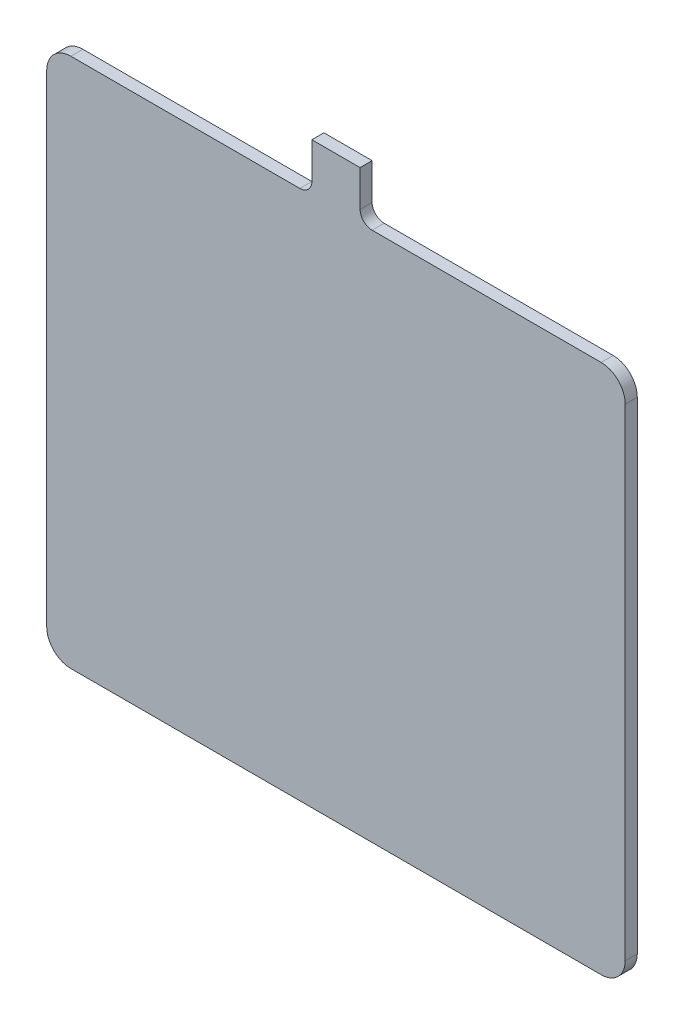
ISO-10303-21;
HEADER;
FILE_DESCRIPTION(('STEP AP214'),'2;1');
FILE_NAME('part.step','',(''),(''),'','','');
FILE_SCHEMA(('AUTOMOTIVE_DESIGN { 1 0 10303 214 1 1 1 1 }'));
ENDSEC;
DATA;
#1=APPLICATION_CONTEXT('core data for automotive mechanical design processes');
#2=APPLICATION_PROTOCOL_DEFINITION('international standard','automotive_design',2000,#1);
#3=PRODUCT_CONTEXT('',#1,'mechanical');
#4=PRODUCT('Part','Part','',(#3));
#5=PRODUCT_RELATED_PRODUCT_CATEGORY('part','',(#4));
#6=PRODUCT_DEFINITION_FORMATION('','',#4);
#7=PRODUCT_DEFINITION_CONTEXT('part definition',#1,'design');
#8=PRODUCT_DEFINITION('design','',#6,#7);
#9=PRODUCT_DEFINITION_SHAPE('','',#8);
#10=(LENGTH_UNIT() NAMED_UNIT(*) SI_UNIT(.MILLI.,.METRE.));
#11=(NAMED_UNIT(*) PLANE_ANGLE_UNIT() SI_UNIT($,.RADIAN.));
#12=(NAMED_UNIT(*) SI_UNIT($,.STERADIAN.) SOLID_ANGLE_UNIT());
#13=UNCERTAINTY_MEASURE_WITH_UNIT(LENGTH_MEASURE(1.E-05),#10,'distance_accuracy_value','');
#14=(GEOMETRIC_REPRESENTATION_CONTEXT(3) GLOBAL_UNCERTAINTY_ASSIGNED_CONTEXT((#13)) GLOBAL_UNIT_ASSIGNED_CONTEXT((#10,
#11,#12)) REPRESENTATION_CONTEXT('',''));
#15=CARTESIAN_POINT('',(0.,0.,0.));
#16=DIRECTION('',(0.,0.,1.));
#17=DIRECTION('',(1.,0.,0.));
#18=AXIS2_PLACEMENT_3D('',#15,#16,#17);
#19=CARTESIAN_POINT('',(-30.,305.,10.));
#20=DIRECTION('',(0.,0.,-1.));
#21=DIRECTION('',(-1.,0.,0.));
#22=AXIS2_PLACEMENT_3D('',#19,#20,#21);
#23=CYLINDRICAL_SURFACE('',#22,10.);
#24=CARTESIAN_POINT('',(-30.,305.,0.));
#25=DIRECTION('',(0.,0.,-1.));
#26=DIRECTION('',(1.,0.,0.));
#27=AXIS2_PLACEMENT_3D('',#24,#25,#26);
#28=CIRCLE('',#27,10.);
#29=CARTESIAN_POINT('',(-20.,305.,0.));
#30=VERTEX_POINT('',#29);
#31=CARTESIAN_POINT('',(-30.,295.,0.));
#32=VERTEX_POINT('',#31);
#33=EDGE_CURVE('E165',#30,#32,#28,.T.);
#34=ORIENTED_EDGE('',*,*,#33,.T.);
#35=DIRECTION('',(0.,0.,-1.));
#36=VECTOR('',#35,1.);
#37=CARTESIAN_POINT('',(-30.,295.,10.));
#38=LINE('',#37,#36);
#39=CARTESIAN_POINT('',(-30.,295.,10.));
#40=VERTEX_POINT('',#39);
#41=EDGE_CURVE('E11',#40,#32,#38,.T.);
#42=ORIENTED_EDGE('',*,*,#41,.F.);
#43=CARTESIAN_POINT('',(-30.,305.,10.));
#44=DIRECTION('',(0.,0.,-1.));
#45=DIRECTION('',(1.,0.,0.));
#46=AXIS2_PLACEMENT_3D('',#43,#44,#45);
#47=CIRCLE('',#46,10.);
#48=CARTESIAN_POINT('',(-20.,305.,10.));
#49=VERTEX_POINT('',#48);
#50=EDGE_CURVE('E191',#49,#40,#47,.T.);
#51=ORIENTED_EDGE('',*,*,#50,.F.);
#52=DIRECTION('',(0.,0.,-1.));
#53=VECTOR('',#52,1.);
#54=CARTESIAN_POINT('',(-20.,305.,10.));
#55=LINE('',#54,#53);
#56=EDGE_CURVE('E161',#49,#30,#55,.T.);
#57=ORIENTED_EDGE('',*,*,#56,.T.);
#58=EDGE_LOOP('',(#34,#42,#51,#57));
#59=FACE_BOUND('',#58,.T.);
#60=ADVANCED_FACE('F33',(#59),#23,.F.);
#61=CARTESIAN_POINT('',(-220.,295.,10.));
#62=DIRECTION('',(0.,-1.,0.));
#63=DIRECTION('',(0.,0.,-1.));
#64=AXIS2_PLACEMENT_3D('',#61,#62,#63);
#65=PLANE('',#64);
#66=DIRECTION('',(-1.,0.,0.));
#67=VECTOR('',#66,1.);
#68=CARTESIAN_POINT('',(-220.,295.,0.));
#69=LINE('',#68,#67);
#70=CARTESIAN_POINT('',(-220.,295.,0.));
#71=VERTEX_POINT('',#70);
#72=EDGE_CURVE('E168',#32,#71,#69,.T.);
#73=ORIENTED_EDGE('',*,*,#72,.T.);
#74=DIRECTION('',(0.,0.,-1.));
#75=VECTOR('',#74,1.);
#76=CARTESIAN_POINT('',(-220.,295.,10.));
#77=LINE('',#76,#75);
#78=CARTESIAN_POINT('',(-220.,295.,10.));
#79=VERTEX_POINT('',#78);
#80=EDGE_CURVE('E41',#79,#71,#77,.T.);
#81=ORIENTED_EDGE('',*,*,#80,.F.);
#82=DIRECTION('',(-1.,0.,0.));
#83=VECTOR('',#82,1.);
#84=CARTESIAN_POINT('',(-220.,295.,10.));
#85=LINE('',#84,#83);
#86=EDGE_CURVE('E110',#40,#79,#85,.T.);
#87=ORIENTED_EDGE('',*,*,#86,.F.);
#88=ORIENTED_EDGE('',*,*,#41,.T.);
#89=EDGE_LOOP('',(#73,#81,#87,#88));
#90=FACE_BOUND('',#89,.T.);
#91=ADVANCED_FACE('F279',(#90),#65,.F.);
#92=CARTESIAN_POINT('',(-220.,275.,10.));
#93=DIRECTION('',(0.,0.,-1.));
#94=DIRECTION('',(-1.,0.,0.));
#95=AXIS2_PLACEMENT_3D('',#92,#93,#94);
#96=CYLINDRICAL_SURFACE('',#95,20.);
#97=CARTESIAN_POINT('',(-220.,275.,0.));
#98=DIRECTION('',(0.,0.,1.));
#99=DIRECTION('',(1.,0.,0.));
#100=AXIS2_PLACEMENT_3D('',#97,#98,#99);
#101=CIRCLE('',#100,20.);
#102=CARTESIAN_POINT('',(-240.,275.,0.));
#103=VERTEX_POINT('',#102);
#104=EDGE_CURVE('E170',#71,#103,#101,.T.);
#105=ORIENTED_EDGE('',*,*,#104,.T.);
#106=DIRECTION('',(0.,0.,-1.));
#107=VECTOR('',#106,1.);
#108=CARTESIAN_POINT('',(-240.,275.,10.));
#109=LINE('',#108,#107);
#110=CARTESIAN_POINT('',(-240.,275.,10.));
#111=VERTEX_POINT('',#110);
#112=EDGE_CURVE('E216',#111,#103,#109,.T.);
#113=ORIENTED_EDGE('',*,*,#112,.F.);
#114=CARTESIAN_POINT('',(-220.,275.,10.));
#115=DIRECTION('',(0.,0.,1.));
#116=DIRECTION('',(1.,0.,0.));
#117=AXIS2_PLACEMENT_3D('',#114,#115,#116);
#118=CIRCLE('',#117,20.);
#119=EDGE_CURVE('E224',#79,#111,#118,.T.);
#120=ORIENTED_EDGE('',*,*,#119,.F.);
#121=ORIENTED_EDGE('',*,*,#80,.T.);
#122=EDGE_LOOP('',(#105,#113,#120,#121));
#123=FACE_BOUND('',#122,.T.);
#124=ADVANCED_FACE('F222',(#123),#96,.T.);
#125=CARTESIAN_POINT('',(-240.,275.,10.));
#126=DIRECTION('',(1.,0.,0.));
#127=DIRECTION('',(0.,1.,0.));
#128=AXIS2_PLACEMENT_3D('',#125,#126,#127);
#129=PLANE('',#128);
#130=DIRECTION('',(0.,-1.,0.));
#131=VECTOR('',#130,1.);
#132=CARTESIAN_POINT('',(-240.,275.,0.));
#133=LINE('',#132,#131);
#134=CARTESIAN_POINT('',(-240.,-125.,0.));
#135=VERTEX_POINT('',#134);
#136=EDGE_CURVE('E172',#103,#135,#133,.T.);
#137=ORIENTED_EDGE('',*,*,#136,.T.);
#138=DIRECTION('',(0.,0.,-1.));
#139=VECTOR('',#138,1.);
#140=CARTESIAN_POINT('',(-240.,-125.,10.));
#141=LINE('',#140,#139);
#142=CARTESIAN_POINT('',(-240.,-125.,10.));
#143=VERTEX_POINT('',#142);
#144=EDGE_CURVE('E213',#143,#135,#141,.T.);
#145=ORIENTED_EDGE('',*,*,#144,.F.);
#146=DIRECTION('',(0.,-1.,0.));
#147=VECTOR('',#146,1.);
#148=CARTESIAN_POINT('',(-240.,275.,10.));
#149=LINE('',#148,#147);
#150=EDGE_CURVE('E242',#111,#143,#149,.T.);
#151=ORIENTED_EDGE('',*,*,#150,.F.);
#152=ORIENTED_EDGE('',*,*,#112,.T.);
#153=EDGE_LOOP('',(#137,#145,#151,#152));
#154=FACE_BOUND('',#153,.T.);
#155=ADVANCED_FACE('F233',(#154),#129,.F.);
#156=CARTESIAN_POINT('',(-220.,-125.,10.));
#157=DIRECTION('',(0.,0.,-1.));
#158=DIRECTION('',(-1.,0.,0.));
#159=AXIS2_PLACEMENT_3D('',#156,#157,#158);
#160=CYLINDRICAL_SURFACE('',#159,20.);
#161=CARTESIAN_POINT('',(-220.,-125.,0.));
#162=DIRECTION('',(0.,0.,1.));
#163=DIRECTION('',(1.,0.,0.));
#164=AXIS2_PLACEMENT_3D('',#161,#162,#163);
#165=CIRCLE('',#164,20.);
#166=CARTESIAN_POINT('',(-220.,-145.,0.));
#167=VERTEX_POINT('',#166);
#168=EDGE_CURVE('E174',#135,#167,#165,.T.);
#169=ORIENTED_EDGE('',*,*,#168,.T.);
#170=DIRECTION('',(0.,0.,-1.));
#171=VECTOR('',#170,1.);
#172=CARTESIAN_POINT('',(-220.,-145.,10.));
#173=LINE('',#172,#171);
#174=CARTESIAN_POINT('',(-220.,-145.,10.));
#175=VERTEX_POINT('',#174);
#176=EDGE_CURVE('E210',#175,#167,#173,.T.);
#177=ORIENTED_EDGE('',*,*,#176,.F.);
#178=CARTESIAN_POINT('',(-220.,-125.,10.));
#179=DIRECTION('',(0.,0.,1.));
#180=DIRECTION('',(1.,0.,0.));
#181=AXIS2_PLACEMENT_3D('',#178,#179,#180);
#182=CIRCLE('',#181,20.);
#183=EDGE_CURVE('E239',#143,#175,#182,.T.);
#184=ORIENTED_EDGE('',*,*,#183,.F.);
#185=ORIENTED_EDGE('',*,*,#144,.T.);
#186=EDGE_LOOP('',(#169,#177,#184,#185));
#187=FACE_BOUND('',#186,.T.);
#188=ADVANCED_FACE('F237',(#187),#160,.T.);
#189=CARTESIAN_POINT('',(-220.,-145.,10.));
#190=DIRECTION('',(0.,1.,0.));
#191=DIRECTION('',(0.,0.,1.));
#192=AXIS2_PLACEMENT_3D('',#189,#190,#191);
#193=PLANE('',#192);
#194=DIRECTION('',(1.,0.,0.));
#195=VECTOR('',#194,1.);
#196=CARTESIAN_POINT('',(-220.,-145.,0.));
#197=LINE('',#196,#195);
#198=CARTESIAN_POINT('',(220.,-145.,0.));
#199=VERTEX_POINT('',#198);
#200=EDGE_CURVE('E176',#167,#199,#197,.T.);
#201=ORIENTED_EDGE('',*,*,#200,.T.);
#202=DIRECTION('',(0.,0.,-1.));
#203=VECTOR('',#202,1.);
#204=CARTESIAN_POINT('',(220.,-145.,10.));
#205=LINE('',#204,#203);
#206=CARTESIAN_POINT('',(220.,-145.,10.));
#207=VERTEX_POINT('',#206);
#208=EDGE_CURVE('E207',#207,#199,#205,.T.);
#209=ORIENTED_EDGE('',*,*,#208,.F.);
#210=DIRECTION('',(1.,0.,0.));
#211=VECTOR('',#210,1.);
#212=CARTESIAN_POINT('',(-220.,-145.,10.));
#213=LINE('',#212,#211);
#214=EDGE_CURVE('E241',#175,#207,#213,.T.);
#215=ORIENTED_EDGE('',*,*,#214,.F.);
#216=ORIENTED_EDGE('',*,*,#176,.T.);
#217=EDGE_LOOP('',(#201,#209,#215,#216));
#218=FACE_BOUND('',#217,.T.);
#219=ADVANCED_FACE('F292',(#218),#193,.F.);
#220=CARTESIAN_POINT('',(220.,-125.,10.));
#221=DIRECTION('',(0.,0.,-1.));
#222=DIRECTION('',(-1.,0.,0.));
#223=AXIS2_PLACEMENT_3D('',#220,#221,#222);
#224=CYLINDRICAL_SURFACE('',#223,20.);
#225=CARTESIAN_POINT('',(220.,-125.,0.));
#226=DIRECTION('',(0.,0.,1.));
#227=DIRECTION('',(1.,0.,0.));
#228=AXIS2_PLACEMENT_3D('',#225,#226,#227);
#229=CIRCLE('',#228,20.);
#230=CARTESIAN_POINT('',(240.,-125.,0.));
#231=VERTEX_POINT('',#230);
#232=EDGE_CURVE('E178',#199,#231,#229,.T.);
#233=ORIENTED_EDGE('',*,*,#232,.T.);
#234=DIRECTION('',(0.,0.,-1.));
#235=VECTOR('',#234,1.);
#236=CARTESIAN_POINT('',(240.,-125.,10.));
#237=LINE('',#236,#235);
#238=CARTESIAN_POINT('',(240.,-125.,10.));
#239=VERTEX_POINT('',#238);
#240=EDGE_CURVE('E204',#239,#231,#237,.T.);
#241=ORIENTED_EDGE('',*,*,#240,.F.);
#242=CARTESIAN_POINT('',(220.,-125.,10.));
#243=DIRECTION('',(0.,0.,1.));
#244=DIRECTION('',(1.,0.,0.));
#245=AXIS2_PLACEMENT_3D('',#242,#243,#244);
#246=CIRCLE('',#245,20.);
#247=EDGE_CURVE('E244',#207,#239,#246,.T.);
#248=ORIENTED_EDGE('',*,*,#247,.F.);
#249=ORIENTED_EDGE('',*,*,#208,.T.);
#250=EDGE_LOOP('',(#233,#241,#248,#249));
#251=FACE_BOUND('',#250,.T.);
#252=ADVANCED_FACE('F295',(#251),#224,.T.);
#253=CARTESIAN_POINT('',(240.,275.,10.));
#254=DIRECTION('',(-1.,0.,0.));
#255=DIRECTION('',(0.,-1.,0.));
#256=AXIS2_PLACEMENT_3D('',#253,#254,#255);
#257=PLANE('',#256);
#258=DIRECTION('',(0.,1.,0.));
#259=VECTOR('',#258,1.);
#260=CARTESIAN_POINT('',(240.,275.,0.));
#261=LINE('',#260,#259);
#262=CARTESIAN_POINT('',(240.,275.,0.));
#263=VERTEX_POINT('',#262);
#264=EDGE_CURVE('E180',#231,#263,#261,.T.);
#265=ORIENTED_EDGE('',*,*,#264,.T.);
#266=DIRECTION('',(0.,0.,-1.));
#267=VECTOR('',#266,1.);
#268=CARTESIAN_POINT('',(240.,275.,10.));
#269=LINE('',#268,#267);
#270=CARTESIAN_POINT('',(240.,275.,10.));
#271=VERTEX_POINT('',#270);
#272=EDGE_CURVE('E201',#271,#263,#269,.T.);
#273=ORIENTED_EDGE('',*,*,#272,.F.);
#274=DIRECTION('',(0.,1.,0.));
#275=VECTOR('',#274,1.);
#276=CARTESIAN_POINT('',(240.,275.,10.));
#277=LINE('',#276,#275);
#278=EDGE_CURVE('E250',#239,#271,#277,.T.);
#279=ORIENTED_EDGE('',*,*,#278,.F.);
#280=ORIENTED_EDGE('',*,*,#240,.T.);
#281=EDGE_LOOP('',(#265,#273,#279,#280));
#282=FACE_BOUND('',#281,.T.);
#283=ADVANCED_FACE('F299',(#282),#257,.F.);
#284=CARTESIAN_POINT('',(220.,275.,10.));
#285=DIRECTION('',(0.,0.,-1.));
#286=DIRECTION('',(-1.,0.,0.));
#287=AXIS2_PLACEMENT_3D('',#284,#285,#286);
#288=CYLINDRICAL_SURFACE('',#287,20.);
#289=CARTESIAN_POINT('',(220.,275.,0.));
#290=DIRECTION('',(0.,0.,1.));
#291=DIRECTION('',(-1.,0.,0.));
#292=AXIS2_PLACEMENT_3D('',#289,#290,#291);
#293=CIRCLE('',#292,20.);
#294=CARTESIAN_POINT('',(220.,295.,0.));
#295=VERTEX_POINT('',#294);
#296=EDGE_CURVE('E182',#263,#295,#293,.T.);
#297=ORIENTED_EDGE('',*,*,#296,.T.);
#298=DIRECTION('',(0.,0.,-1.));
#299=VECTOR('',#298,1.);
#300=CARTESIAN_POINT('',(220.,295.,10.));
#301=LINE('',#300,#299);
#302=CARTESIAN_POINT('',(220.,295.,10.));
#303=VERTEX_POINT('',#302);
#304=EDGE_CURVE('E198',#303,#295,#301,.T.);
#305=ORIENTED_EDGE('',*,*,#304,.F.);
#306=CARTESIAN_POINT('',(220.,275.,10.));
#307=DIRECTION('',(0.,0.,1.));
#308=DIRECTION('',(-1.,0.,0.));
#309=AXIS2_PLACEMENT_3D('',#306,#307,#308);
#310=CIRCLE('',#309,20.);
#311=EDGE_CURVE('E252',#271,#303,#310,.T.);
#312=ORIENTED_EDGE('',*,*,#311,.F.);
#313=ORIENTED_EDGE('',*,*,#272,.T.);
#314=EDGE_LOOP('',(#297,#305,#312,#313));
#315=FACE_BOUND('',#314,.T.);
#316=ADVANCED_FACE('F303',(#315),#288,.T.);
#317=CARTESIAN_POINT('',(30.0000000000001,295.,10.));
#318=DIRECTION('',(0.,-1.,0.));
#319=DIRECTION('',(0.,0.,-1.));
#320=AXIS2_PLACEMENT_3D('',#317,#318,#319);
#321=PLANE('',#320);
#322=DIRECTION('',(-1.,0.,0.));
#323=VECTOR('',#322,1.);
#324=CARTESIAN_POINT('',(30.0000000000001,295.,0.));
#325=LINE('',#324,#323);
#326=CARTESIAN_POINT('',(30.0000000000001,295.,0.));
#327=VERTEX_POINT('',#326);
#328=EDGE_CURVE('E184',#295,#327,#325,.T.);
#329=ORIENTED_EDGE('',*,*,#328,.T.);
#330=DIRECTION('',(0.,0.,-1.));
#331=VECTOR('',#330,1.);
#332=CARTESIAN_POINT('',(30.0000000000001,295.,10.));
#333=LINE('',#332,#331);
#334=CARTESIAN_POINT('',(30.0000000000001,295.,10.));
#335=VERTEX_POINT('',#334);
#336=EDGE_CURVE('E195',#335,#327,#333,.T.);
#337=ORIENTED_EDGE('',*,*,#336,.F.);
#338=DIRECTION('',(-1.,0.,0.));
#339=VECTOR('',#338,1.);
#340=CARTESIAN_POINT('',(30.0000000000001,295.,10.));
#341=LINE('',#340,#339);
#342=EDGE_CURVE('E254',#303,#335,#341,.T.);
#343=ORIENTED_EDGE('',*,*,#342,.F.);
#344=ORIENTED_EDGE('',*,*,#304,.T.);
#345=EDGE_LOOP('',(#329,#337,#343,#344));
#346=FACE_BOUND('',#345,.T.);
#347=ADVANCED_FACE('F260',(#346),#321,.F.);
#348=CARTESIAN_POINT('',(30.,305.,10.));
#349=DIRECTION('',(0.,0.,-1.));
#350=DIRECTION('',(-1.,0.,0.));
#351=AXIS2_PLACEMENT_3D('',#348,#349,#350);
#352=CYLINDRICAL_SURFACE('',#351,10.);
#353=CARTESIAN_POINT('',(30.,305.,0.));
#354=DIRECTION('',(0.,0.,-1.));
#355=DIRECTION('',(-1.,0.,0.));
#356=AXIS2_PLACEMENT_3D('',#353,#354,#355);
#357=CIRCLE('',#356,10.);
#358=CARTESIAN_POINT('',(20.,305.,0.));
#359=VERTEX_POINT('',#358);
#360=EDGE_CURVE('E186',#327,#359,#357,.T.);
#361=ORIENTED_EDGE('',*,*,#360,.T.);
#362=DIRECTION('',(0.,0.,-1.));
#363=VECTOR('',#362,1.);
#364=CARTESIAN_POINT('',(20.,305.,10.));
#365=LINE('',#364,#363);
#366=CARTESIAN_POINT('',(20.,305.,10.));
#367=VERTEX_POINT('',#366);
#368=EDGE_CURVE('E156',#367,#359,#365,.T.);
#369=ORIENTED_EDGE('',*,*,#368,.F.);
#370=CARTESIAN_POINT('',(30.,305.,10.));
#371=DIRECTION('',(0.,0.,-1.));
#372=DIRECTION('',(-1.,0.,0.));
#373=AXIS2_PLACEMENT_3D('',#370,#371,#372);
#374=CIRCLE('',#373,10.);
#375=EDGE_CURVE('E147',#335,#367,#374,.T.);
#376=ORIENTED_EDGE('',*,*,#375,.F.);
#377=ORIENTED_EDGE('',*,*,#336,.T.);
#378=EDGE_LOOP('',(#361,#369,#376,#377));
#379=FACE_BOUND('',#378,.T.);
#380=ADVANCED_FACE('F264',(#379),#352,.F.);
#381=CARTESIAN_POINT('',(20.,305.,10.));
#382=DIRECTION('',(-1.,0.,0.));
#383=DIRECTION('',(0.,-1.,0.));
#384=AXIS2_PLACEMENT_3D('',#381,#382,#383);
#385=PLANE('',#384);
#386=DIRECTION('',(0.,1.,0.));
#387=VECTOR('',#386,1.);
#388=CARTESIAN_POINT('',(20.,305.,0.));
#389=LINE('',#388,#387);
#390=CARTESIAN_POINT('',(20.,335.,0.));
#391=VERTEX_POINT('',#390);
#392=EDGE_CURVE('E155',#359,#391,#389,.T.);
#393=ORIENTED_EDGE('',*,*,#392,.T.);
#394=DIRECTION('',(0.,0.,-1.));
#395=VECTOR('',#394,1.);
#396=CARTESIAN_POINT('',(20.,335.,10.));
#397=LINE('',#396,#395);
#398=CARTESIAN_POINT('',(20.,335.,10.));
#399=VERTEX_POINT('',#398);
#400=EDGE_CURVE('E152',#399,#391,#397,.T.);
#401=ORIENTED_EDGE('',*,*,#400,.F.);
#402=DIRECTION('',(0.,1.,0.));
#403=VECTOR('',#402,1.);
#404=CARTESIAN_POINT('',(20.,305.,10.));
#405=LINE('',#404,#403);
#406=EDGE_CURVE('E141',#367,#399,#405,.T.);
#407=ORIENTED_EDGE('',*,*,#406,.F.);
#408=ORIENTED_EDGE('',*,*,#368,.T.);
#409=EDGE_LOOP('',(#393,#401,#407,#408));
#410=FACE_BOUND('',#409,.T.);
#411=ADVANCED_FACE('F153',(#410),#385,.F.);
#412=CARTESIAN_POINT('',(-20.,335.,10.));
#413=DIRECTION('',(0.,-1.,0.));
#414=DIRECTION('',(1.,0.,0.));
#415=AXIS2_PLACEMENT_3D('',#412,#413,#414);
#416=PLANE('',#415);
#417=DIRECTION('',(-1.,0.,0.));
#418=VECTOR('',#417,1.);
#419=CARTESIAN_POINT('',(-20.,335.,0.));
#420=LINE('',#419,#418);
#421=CARTESIAN_POINT('',(-20.,335.,0.));
#422=VERTEX_POINT('',#421);
#423=EDGE_CURVE('E96',#391,#422,#420,.T.);
#424=ORIENTED_EDGE('',*,*,#423,.T.);
#425=DIRECTION('',(0.,0.,-1.));
#426=VECTOR('',#425,1.);
#427=CARTESIAN_POINT('',(-20.,335.,10.));
#428=LINE('',#427,#426);
#429=CARTESIAN_POINT('',(-20.,335.,10.));
#430=VERTEX_POINT('',#429);
#431=EDGE_CURVE('E157',#430,#422,#428,.T.);
#432=ORIENTED_EDGE('',*,*,#431,.F.);
#433=DIRECTION('',(-1.,0.,0.));
#434=VECTOR('',#433,1.);
#435=CARTESIAN_POINT('',(-20.,335.,10.));
#436=LINE('',#435,#434);
#437=EDGE_CURVE('E145',#399,#430,#436,.T.);
#438=ORIENTED_EDGE('',*,*,#437,.F.);
#439=ORIENTED_EDGE('',*,*,#400,.T.);
#440=EDGE_LOOP('',(#424,#432,#438,#439));
#441=FACE_BOUND('',#440,.T.);
#442=ADVANCED_FACE('F159',(#441),#416,.F.);
#443=CARTESIAN_POINT('',(-20.,305.,10.));
#444=DIRECTION('',(1.,0.,0.));
#445=DIRECTION('',(0.,1.,0.));
#446=AXIS2_PLACEMENT_3D('',#443,#444,#445);
#447=PLANE('',#446);
#448=DIRECTION('',(0.,-1.,0.));
#449=VECTOR('',#448,1.);
#450=CARTESIAN_POINT('',(-20.,305.,0.));
#451=LINE('',#450,#449);
#452=EDGE_CURVE('E102',#422,#30,#451,.T.);
#453=ORIENTED_EDGE('',*,*,#452,.T.);
#454=ORIENTED_EDGE('',*,*,#56,.F.);
#455=DIRECTION('',(0.,-1.,0.));
#456=VECTOR('',#455,1.);
#457=CARTESIAN_POINT('',(-20.,305.,10.));
#458=LINE('',#457,#456);
#459=EDGE_CURVE('E49',#430,#49,#458,.T.);
#460=ORIENTED_EDGE('',*,*,#459,.F.);
#461=ORIENTED_EDGE('',*,*,#431,.T.);
#462=EDGE_LOOP('',(#453,#454,#460,#461));
#463=FACE_BOUND('',#462,.T.);
#464=ADVANCED_FACE('F268',(#463),#447,.F.);
#465=CARTESIAN_POINT('',(-30.,305.,10.));
#466=DIRECTION('',(0.,0.,1.));
#467=DIRECTION('',(1.,0.,0.));
#468=AXIS2_PLACEMENT_3D('',#465,#466,#467);
#469=PLANE('',#468);
#470=ORIENTED_EDGE('',*,*,#50,.T.);
#471=ORIENTED_EDGE('',*,*,#86,.T.);
#472=ORIENTED_EDGE('',*,*,#119,.T.);
#473=ORIENTED_EDGE('',*,*,#150,.T.);
#474=ORIENTED_EDGE('',*,*,#183,.T.);
#475=ORIENTED_EDGE('',*,*,#214,.T.);
#476=ORIENTED_EDGE('',*,*,#247,.T.);
#477=ORIENTED_EDGE('',*,*,#278,.T.);
#478=ORIENTED_EDGE('',*,*,#311,.T.);
#479=ORIENTED_EDGE('',*,*,#342,.T.);
#480=ORIENTED_EDGE('',*,*,#375,.T.);
#481=ORIENTED_EDGE('',*,*,#406,.T.);
#482=ORIENTED_EDGE('',*,*,#437,.T.);
#483=ORIENTED_EDGE('',*,*,#459,.T.);
#484=EDGE_LOOP('',(#470,#471,#472,#473,#474,#475,#476,#477,#478,#479,#480,#481,#482,#483));
#485=FACE_BOUND('',#484,.T.);
#486=ADVANCED_FACE('F143',(#485),#469,.T.);
#487=CARTESIAN_POINT('',(-30.,305.,0.));
#488=DIRECTION('',(0.,0.,1.));
#489=DIRECTION('',(1.,0.,0.));
#490=AXIS2_PLACEMENT_3D('',#487,#488,#489);
#491=PLANE('',#490);
#492=ORIENTED_EDGE('',*,*,#33,.F.);
#493=ORIENTED_EDGE('',*,*,#452,.F.);
#494=ORIENTED_EDGE('',*,*,#423,.F.);
#495=ORIENTED_EDGE('',*,*,#392,.F.);
#496=ORIENTED_EDGE('',*,*,#360,.F.);
#497=ORIENTED_EDGE('',*,*,#328,.F.);
#498=ORIENTED_EDGE('',*,*,#296,.F.);
#499=ORIENTED_EDGE('',*,*,#264,.F.);
#500=ORIENTED_EDGE('',*,*,#232,.F.);
#501=ORIENTED_EDGE('',*,*,#200,.F.);
#502=ORIENTED_EDGE('',*,*,#168,.F.);
#503=ORIENTED_EDGE('',*,*,#136,.F.);
#504=ORIENTED_EDGE('',*,*,#104,.F.);
#505=ORIENTED_EDGE('',*,*,#72,.F.);
#506=EDGE_LOOP('',(#492,#493,#494,#495,#496,#497,#498,#499,#500,#501,#502,#503,#504,#505));
#507=FACE_BOUND('',#506,.T.);
#508=ADVANCED_FACE('F228',(#507),#491,.F.);
#509=CLOSED_SHELL('',(#60,#91,#124,#155,#188,#219,#252,#283,#316,#347,#380,#411,#442,#464,#486,#508));
#510=MANIFOLD_SOLID_BREP('B2',#509);
#511=ADVANCED_BREP_SHAPE_REPRESENTATION('',(#18,#510),#14);
#512=SHAPE_DEFINITION_REPRESENTATION(#9,#511);
ENDSEC;
END-ISO-10303-21;
